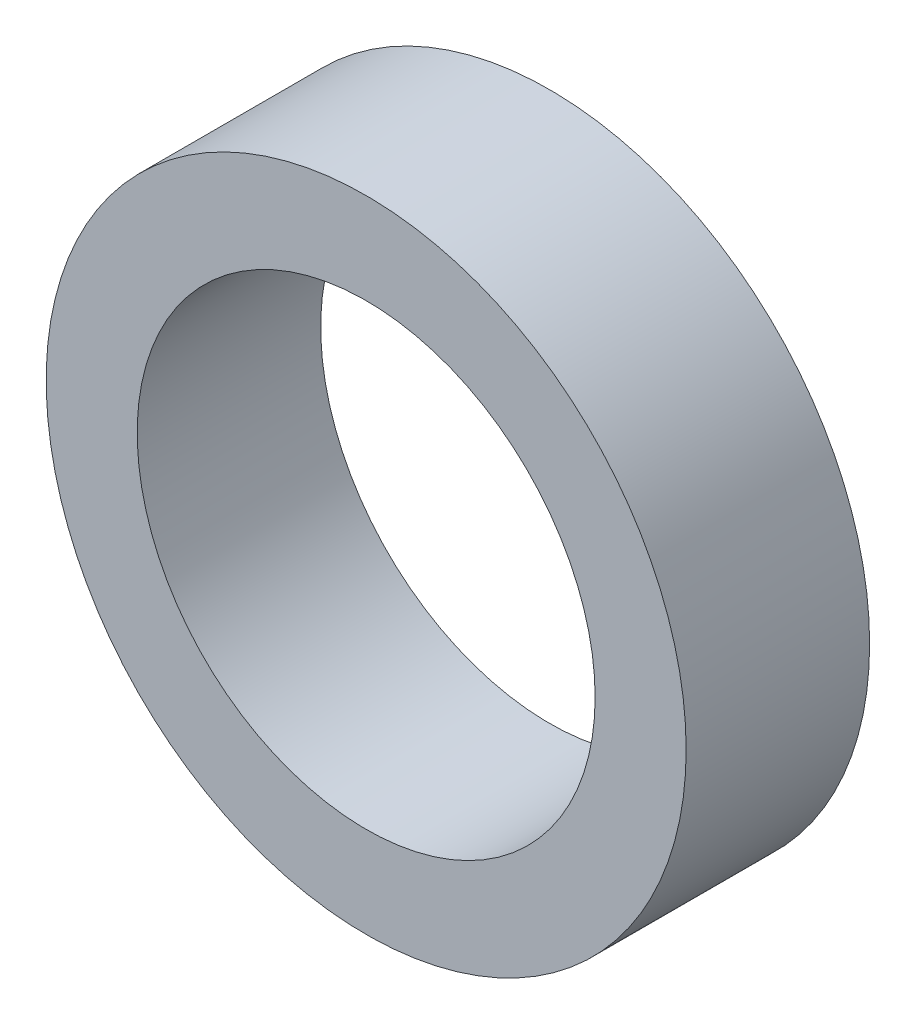
ISO-10303-21;
HEADER;
FILE_DESCRIPTION(('STEP AP214'),'2;1');
FILE_NAME('part.step','',(''),(''),'','','');
FILE_SCHEMA(('AUTOMOTIVE_DESIGN { 1 0 10303 214 1 1 1 1 }'));
ENDSEC;
DATA;
#1=APPLICATION_CONTEXT('core data for automotive mechanical design processes');
#2=APPLICATION_PROTOCOL_DEFINITION('international standard','automotive_design',2000,#1);
#3=PRODUCT_CONTEXT('',#1,'mechanical');
#4=PRODUCT('Part','Part','',(#3));
#5=PRODUCT_RELATED_PRODUCT_CATEGORY('part','',(#4));
#6=PRODUCT_DEFINITION_FORMATION('','',#4);
#7=PRODUCT_DEFINITION_CONTEXT('part definition',#1,'design');
#8=PRODUCT_DEFINITION('design','',#6,#7);
#9=PRODUCT_DEFINITION_SHAPE('','',#8);
#10=(LENGTH_UNIT() NAMED_UNIT(*) SI_UNIT(.MILLI.,.METRE.));
#11=(NAMED_UNIT(*) PLANE_ANGLE_UNIT() SI_UNIT($,.RADIAN.));
#12=(NAMED_UNIT(*) SI_UNIT($,.STERADIAN.) SOLID_ANGLE_UNIT());
#13=UNCERTAINTY_MEASURE_WITH_UNIT(LENGTH_MEASURE(1.E-05),#10,'distance_accuracy_value','');
#14=(GEOMETRIC_REPRESENTATION_CONTEXT(3) GLOBAL_UNCERTAINTY_ASSIGNED_CONTEXT((#13)) GLOBAL_UNIT_ASSIGNED_CONTEXT((#10,
#11,#12)) REPRESENTATION_CONTEXT('',''));
#15=CARTESIAN_POINT('',(0.,0.,0.));
#16=DIRECTION('',(0.,0.,1.));
#17=DIRECTION('',(1.,0.,0.));
#18=AXIS2_PLACEMENT_3D('',#15,#16,#17);
#19=CARTESIAN_POINT('',(0.,0.,12.7));
#20=DIRECTION('',(0.,0.,1.));
#21=DIRECTION('',(1.,0.,0.));
#22=AXIS2_PLACEMENT_3D('',#19,#20,#21);
#23=PLANE('',#22);
#24=CARTESIAN_POINT('',(0.,0.,12.7));
#25=DIRECTION('',(0.,0.,1.));
#26=DIRECTION('',(1.,0.,0.));
#27=AXIS2_PLACEMENT_3D('',#24,#25,#26);
#28=CIRCLE('',#27,22.15);
#29=CARTESIAN_POINT('',(22.15,0.,12.7));
#30=VERTEX_POINT('',#29);
#31=EDGE_CURVE('E10',#30,#30,#28,.T.);
#32=ORIENTED_EDGE('',*,*,#31,.T.);
#33=EDGE_LOOP('',(#32));
#34=FACE_BOUND('',#33,.T.);
#35=CARTESIAN_POINT('',(0.,0.,12.7));
#36=DIRECTION('',(0.,0.,1.));
#37=DIRECTION('',(1.,0.,0.));
#38=AXIS2_PLACEMENT_3D('',#35,#36,#37);
#39=CIRCLE('',#38,15.85);
#40=CARTESIAN_POINT('',(15.85,0.,12.7));
#41=VERTEX_POINT('',#40);
#42=EDGE_CURVE('E42',#41,#41,#39,.T.);
#43=ORIENTED_EDGE('',*,*,#42,.F.);
#44=EDGE_LOOP('',(#43));
#45=FACE_BOUND('',#44,.T.);
#46=ADVANCED_FACE('F31',(#34,#45),#23,.T.);
#47=CARTESIAN_POINT('',(0.,0.,0.));
#48=DIRECTION('',(0.,0.,1.));
#49=DIRECTION('',(1.,0.,0.));
#50=AXIS2_PLACEMENT_3D('',#47,#48,#49);
#51=PLANE('',#50);
#52=CARTESIAN_POINT('',(0.,0.,0.));
#53=DIRECTION('',(0.,0.,1.));
#54=DIRECTION('',(1.,0.,0.));
#55=AXIS2_PLACEMENT_3D('',#52,#53,#54);
#56=CIRCLE('',#55,22.15);
#57=CARTESIAN_POINT('',(22.15,0.,0.));
#58=VERTEX_POINT('',#57);
#59=EDGE_CURVE('E35',#58,#58,#56,.T.);
#60=ORIENTED_EDGE('',*,*,#59,.F.);
#61=EDGE_LOOP('',(#60));
#62=FACE_BOUND('',#61,.T.);
#63=CARTESIAN_POINT('',(0.,0.,0.));
#64=DIRECTION('',(0.,0.,1.));
#65=DIRECTION('',(1.,0.,0.));
#66=AXIS2_PLACEMENT_3D('',#63,#64,#65);
#67=CIRCLE('',#66,15.85);
#68=CARTESIAN_POINT('',(15.85,0.,0.));
#69=VERTEX_POINT('',#68);
#70=EDGE_CURVE('E44',#69,#69,#67,.T.);
#71=ORIENTED_EDGE('',*,*,#70,.T.);
#72=EDGE_LOOP('',(#71));
#73=FACE_BOUND('',#72,.T.);
#74=ADVANCED_FACE('F54',(#62,#73),#51,.F.);
#75=CARTESIAN_POINT('',(0.,0.,12.7));
#76=DIRECTION('',(0.,0.,-1.));
#77=DIRECTION('',(-1.,0.,0.));
#78=AXIS2_PLACEMENT_3D('',#75,#76,#77);
#79=CYLINDRICAL_SURFACE('',#78,22.15);
#80=ORIENTED_EDGE('',*,*,#31,.F.);
#81=EDGE_LOOP('',(#80));
#82=FACE_BOUND('',#81,.T.);
#83=ORIENTED_EDGE('',*,*,#59,.T.);
#84=EDGE_LOOP('',(#83));
#85=FACE_BOUND('',#84,.T.);
#86=ADVANCED_FACE('F33',(#82,#85),#79,.T.);
#87=CARTESIAN_POINT('',(0.,0.,12.7));
#88=DIRECTION('',(0.,0.,-1.));
#89=DIRECTION('',(-1.,0.,0.));
#90=AXIS2_PLACEMENT_3D('',#87,#88,#89);
#91=CYLINDRICAL_SURFACE('',#90,15.85);
#92=ORIENTED_EDGE('',*,*,#42,.T.);
#93=EDGE_LOOP('',(#92));
#94=FACE_BOUND('',#93,.T.);
#95=ORIENTED_EDGE('',*,*,#70,.F.);
#96=EDGE_LOOP('',(#95));
#97=FACE_BOUND('',#96,.T.);
#98=ADVANCED_FACE('F50',(#94,#97),#91,.F.);
#99=CLOSED_SHELL('',(#46,#74,#86,#98));
#100=MANIFOLD_SOLID_BREP('B2',#99);
#101=ADVANCED_BREP_SHAPE_REPRESENTATION('',(#18,#100),#14);
#102=SHAPE_DEFINITION_REPRESENTATION(#9,#101);
ENDSEC;
END-ISO-10303-21;
